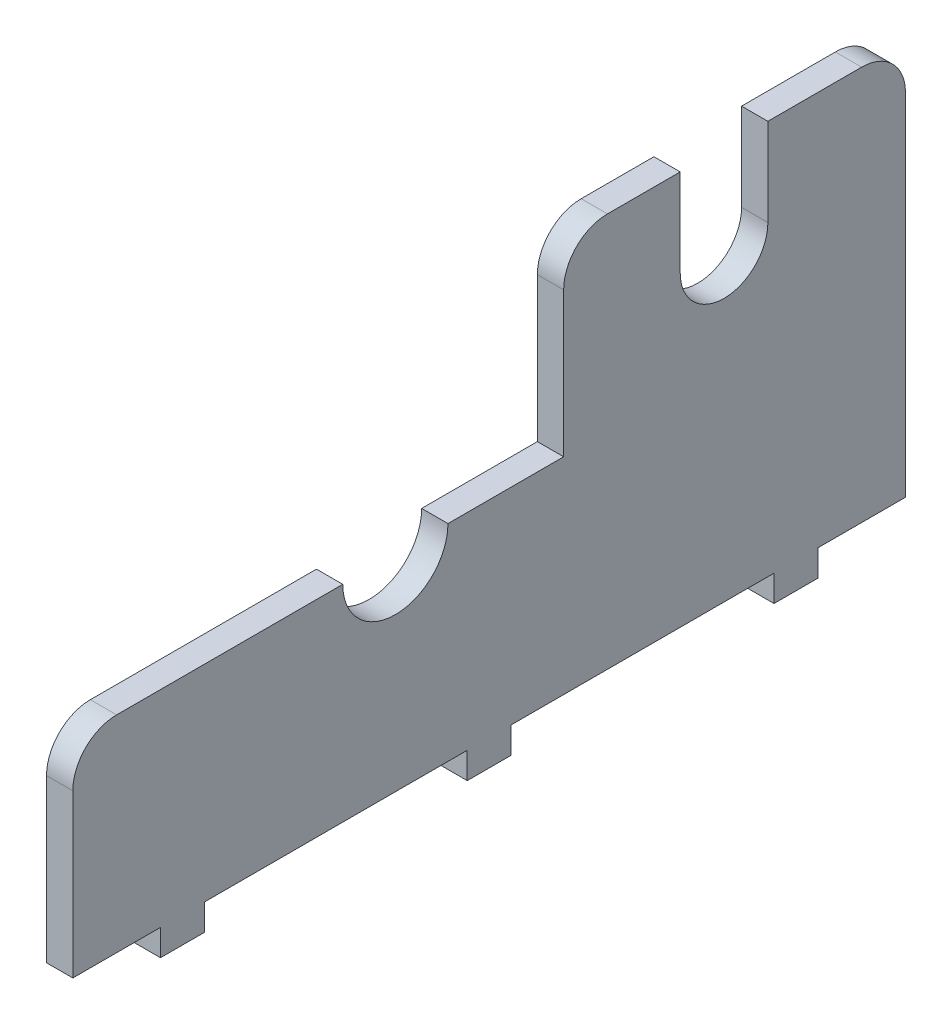
ISO-10303-21;
HEADER;
FILE_DESCRIPTION(('STEP AP214'),'2;1');
FILE_NAME('part.step','',(''),(''),'','','');
FILE_SCHEMA(('AUTOMOTIVE_DESIGN { 1 0 10303 214 1 1 1 1 }'));
ENDSEC;
DATA;
#1=APPLICATION_CONTEXT('core data for automotive mechanical design processes');
#2=APPLICATION_PROTOCOL_DEFINITION('international standard','automotive_design',2000,#1);
#3=PRODUCT_CONTEXT('',#1,'mechanical');
#4=PRODUCT('Part','Part','',(#3));
#5=PRODUCT_RELATED_PRODUCT_CATEGORY('part','',(#4));
#6=PRODUCT_DEFINITION_FORMATION('','',#4);
#7=PRODUCT_DEFINITION_CONTEXT('part definition',#1,'design');
#8=PRODUCT_DEFINITION('design','',#6,#7);
#9=PRODUCT_DEFINITION_SHAPE('','',#8);
#10=(LENGTH_UNIT() NAMED_UNIT(*) SI_UNIT(.MILLI.,.METRE.));
#11=(NAMED_UNIT(*) PLANE_ANGLE_UNIT() SI_UNIT($,.RADIAN.));
#12=(NAMED_UNIT(*) SI_UNIT($,.STERADIAN.) SOLID_ANGLE_UNIT());
#13=UNCERTAINTY_MEASURE_WITH_UNIT(LENGTH_MEASURE(1.E-05),#10,'distance_accuracy_value','');
#14=(GEOMETRIC_REPRESENTATION_CONTEXT(3) GLOBAL_UNCERTAINTY_ASSIGNED_CONTEXT((#13)) GLOBAL_UNIT_ASSIGNED_CONTEXT((#10,
#11,#12)) REPRESENTATION_CONTEXT('',''));
#15=CARTESIAN_POINT('',(0.,0.,0.));
#16=DIRECTION('',(0.,0.,1.));
#17=DIRECTION('',(1.,0.,0.));
#18=AXIS2_PLACEMENT_3D('',#15,#16,#17);
#19=CARTESIAN_POINT('',(3.,0.,-65.));
#20=DIRECTION('',(0.,1.,0.));
#21=DIRECTION('',(0.,0.,1.));
#22=AXIS2_PLACEMENT_3D('',#19,#20,#21);
#23=PLANE('',#22);
#24=DIRECTION('',(-1.,0.,0.));
#25=VECTOR('',#24,1.);
#26=CARTESIAN_POINT('',(3.,0.,-50.));
#27=LINE('',#26,#25);
#28=CARTESIAN_POINT('',(3.,0.,-50.));
#29=VERTEX_POINT('',#28);
#30=CARTESIAN_POINT('',(0.,0.,-50.));
#31=VERTEX_POINT('',#30);
#32=EDGE_CURVE('E62',#29,#31,#27,.T.);
#33=ORIENTED_EDGE('',*,*,#32,.F.);
#34=DIRECTION('',(0.,0.,-1.));
#35=VECTOR('',#34,1.);
#36=CARTESIAN_POINT('',(3.,0.,-65.));
#37=LINE('',#36,#35);
#38=CARTESIAN_POINT('',(3.,0.,-20.));
#39=VERTEX_POINT('',#38);
#40=EDGE_CURVE('E242',#39,#29,#37,.T.);
#41=ORIENTED_EDGE('',*,*,#40,.F.);
#42=DIRECTION('',(1.,0.,0.));
#43=VECTOR('',#42,1.);
#44=CARTESIAN_POINT('',(3.,0.,-20.));
#45=LINE('',#44,#43);
#46=CARTESIAN_POINT('',(0.,0.,-20.));
#47=VERTEX_POINT('',#46);
#48=EDGE_CURVE('E246',#47,#39,#45,.T.);
#49=ORIENTED_EDGE('',*,*,#48,.F.);
#50=DIRECTION('',(0.,0.,-1.));
#51=VECTOR('',#50,1.);
#52=CARTESIAN_POINT('',(0.,0.,-65.));
#53=LINE('',#52,#51);
#54=EDGE_CURVE('E441',#47,#31,#53,.T.);
#55=ORIENTED_EDGE('',*,*,#54,.T.);
#56=EDGE_LOOP('',(#33,#41,#49,#55));
#57=FACE_BOUND('',#56,.T.);
#58=ADVANCED_FACE('F39',(#57),#23,.F.);
#59=DIRECTION('',(1.,0.,0.));
#60=VECTOR('',#59,1.);
#61=CARTESIAN_POINT('',(3.,0.,-55.));
#62=LINE('',#61,#60);
#63=CARTESIAN_POINT('',(0.,0.,-55.));
#64=VERTEX_POINT('',#63);
#65=CARTESIAN_POINT('',(3.,0.,-55.));
#66=VERTEX_POINT('',#65);
#67=EDGE_CURVE('E237',#64,#66,#62,.T.);
#68=ORIENTED_EDGE('',*,*,#67,.F.);
#69=CARTESIAN_POINT('',(0.,0.,-65.));
#70=VERTEX_POINT('',#69);
#71=EDGE_CURVE('E365',#64,#70,#53,.T.);
#72=ORIENTED_EDGE('',*,*,#71,.T.);
#73=DIRECTION('',(-1.,0.,0.));
#74=VECTOR('',#73,1.);
#75=CARTESIAN_POINT('',(3.,0.,-65.));
#76=LINE('',#75,#74);
#77=CARTESIAN_POINT('',(3.,0.,-65.));
#78=VERTEX_POINT('',#77);
#79=EDGE_CURVE('E363',#78,#70,#76,.T.);
#80=ORIENTED_EDGE('',*,*,#79,.F.);
#81=EDGE_CURVE('E54',#66,#78,#37,.T.);
#82=ORIENTED_EDGE('',*,*,#81,.F.);
#83=EDGE_LOOP('',(#68,#72,#80,#82));
#84=FACE_BOUND('',#83,.T.);
#85=ADVANCED_FACE('F443',(#84),#23,.F.);
#86=DIRECTION('',(-1.,0.,0.));
#87=VECTOR('',#86,1.);
#88=CARTESIAN_POINT('',(3.,0.,-15.));
#89=LINE('',#88,#87);
#90=CARTESIAN_POINT('',(3.,0.,-15.));
#91=VERTEX_POINT('',#90);
#92=CARTESIAN_POINT('',(0.,0.,-15.));
#93=VERTEX_POINT('',#92);
#94=EDGE_CURVE('E243',#91,#93,#89,.T.);
#95=ORIENTED_EDGE('',*,*,#94,.F.);
#96=CARTESIAN_POINT('',(3.,0.,15.));
#97=VERTEX_POINT('',#96);
#98=EDGE_CURVE('E358',#97,#91,#37,.T.);
#99=ORIENTED_EDGE('',*,*,#98,.F.);
#100=DIRECTION('',(1.,0.,0.));
#101=VECTOR('',#100,1.);
#102=CARTESIAN_POINT('',(3.,0.,15.));
#103=LINE('',#102,#101);
#104=CARTESIAN_POINT('',(0.,0.,15.));
#105=VERTEX_POINT('',#104);
#106=EDGE_CURVE('E319',#105,#97,#103,.T.);
#107=ORIENTED_EDGE('',*,*,#106,.F.);
#108=EDGE_CURVE('E369',#105,#93,#53,.T.);
#109=ORIENTED_EDGE('',*,*,#108,.T.);
#110=EDGE_LOOP('',(#95,#99,#107,#109));
#111=FACE_BOUND('',#110,.T.);
#112=ADVANCED_FACE('F438',(#111),#23,.F.);
#113=CARTESIAN_POINT('',(0.,45.,0.));
#114=DIRECTION('',(0.,-1.,0.));
#115=DIRECTION('',(0.,0.,-1.));
#116=AXIS2_PLACEMENT_3D('',#113,#114,#115);
#117=PLANE('',#116);
#118=DIRECTION('',(0.,0.,1.));
#119=VECTOR('',#118,1.);
#120=CARTESIAN_POINT('',(0.,45.,-26.));
#121=LINE('',#120,#119);
#122=CARTESIAN_POINT('',(0.,45.,-39.3));
#123=VERTEX_POINT('',#122);
#124=CARTESIAN_POINT('',(0.,45.,-31.));
#125=VERTEX_POINT('',#124);
#126=EDGE_CURVE('E305',#123,#125,#121,.T.);
#127=ORIENTED_EDGE('',*,*,#126,.T.);
#128=DIRECTION('',(1.,0.,0.));
#129=VECTOR('',#128,1.);
#130=CARTESIAN_POINT('',(0.,45.,-31.));
#131=LINE('',#130,#129);
#132=CARTESIAN_POINT('',(3.,45.,-31.));
#133=VERTEX_POINT('',#132);
#134=EDGE_CURVE('E399',#125,#133,#131,.T.);
#135=ORIENTED_EDGE('',*,*,#134,.T.);
#136=DIRECTION('',(0.,0.,-1.));
#137=VECTOR('',#136,1.);
#138=CARTESIAN_POINT('',(3.,45.,-26.));
#139=LINE('',#138,#137);
#140=CARTESIAN_POINT('',(3.,45.,-39.3));
#141=VERTEX_POINT('',#140);
#142=EDGE_CURVE('E306',#133,#141,#139,.T.);
#143=ORIENTED_EDGE('',*,*,#142,.T.);
#144=DIRECTION('',(1.,0.,0.));
#145=VECTOR('',#144,1.);
#146=CARTESIAN_POINT('',(0.,45.,-39.3));
#147=LINE('',#146,#145);
#148=EDGE_CURVE('E295',#123,#141,#147,.T.);
#149=ORIENTED_EDGE('',*,*,#148,.F.);
#150=EDGE_LOOP('',(#127,#135,#143,#149));
#151=FACE_BOUND('',#150,.T.);
#152=ADVANCED_FACE('F487',(#151),#117,.F.);
#153=CARTESIAN_POINT('',(3.,23.5,-65.));
#154=DIRECTION('',(0.,-1.,0.));
#155=DIRECTION('',(0.,0.,-1.));
#156=AXIS2_PLACEMENT_3D('',#153,#154,#155);
#157=PLANE('',#156);
#158=DIRECTION('',(1.,0.,0.));
#159=VECTOR('',#158,1.);
#160=CARTESIAN_POINT('',(0.,23.5,-26.));
#161=LINE('',#160,#159);
#162=CARTESIAN_POINT('',(0.,23.5,-26.));
#163=VERTEX_POINT('',#162);
#164=CARTESIAN_POINT('',(3.,23.5,-26.));
#165=VERTEX_POINT('',#164);
#166=EDGE_CURVE('E294',#163,#165,#161,.T.);
#167=ORIENTED_EDGE('',*,*,#166,.F.);
#168=DIRECTION('',(0.,0.,1.));
#169=VECTOR('',#168,1.);
#170=CARTESIAN_POINT('',(0.,23.5,-65.));
#171=LINE('',#170,#169);
#172=CARTESIAN_POINT('',(0.,23.5,-12.8));
#173=VERTEX_POINT('',#172);
#174=EDGE_CURVE('E353',#163,#173,#171,.T.);
#175=ORIENTED_EDGE('',*,*,#174,.T.);
#176=DIRECTION('',(1.,0.,0.));
#177=VECTOR('',#176,1.);
#178=CARTESIAN_POINT('',(0.,23.5,-12.8));
#179=LINE('',#178,#177);
#180=CARTESIAN_POINT('',(3.,23.5,-12.8));
#181=VERTEX_POINT('',#180);
#182=EDGE_CURVE('E347',#173,#181,#179,.T.);
#183=ORIENTED_EDGE('',*,*,#182,.T.);
#184=DIRECTION('',(0.,0.,1.));
#185=VECTOR('',#184,1.);
#186=CARTESIAN_POINT('',(3.,23.5,-65.));
#187=LINE('',#186,#185);
#188=EDGE_CURVE('E361',#165,#181,#187,.T.);
#189=ORIENTED_EDGE('',*,*,#188,.F.);
#190=EDGE_LOOP('',(#167,#175,#183,#189));
#191=FACE_BOUND('',#190,.T.);
#192=ADVANCED_FACE('F491',(#191),#157,.F.);
#193=DIRECTION('',(-1.,0.,0.));
#194=VECTOR('',#193,1.);
#195=CARTESIAN_POINT('',(3.,0.,20.));
#196=LINE('',#195,#194);
#197=CARTESIAN_POINT('',(3.,0.,20.));
#198=VERTEX_POINT('',#197);
#199=CARTESIAN_POINT('',(0.,0.,20.));
#200=VERTEX_POINT('',#199);
#201=EDGE_CURVE('E314',#198,#200,#196,.T.);
#202=ORIENTED_EDGE('',*,*,#201,.F.);
#203=CARTESIAN_POINT('',(3.,0.,30.));
#204=VERTEX_POINT('',#203);
#205=EDGE_CURVE('E354',#204,#198,#37,.T.);
#206=ORIENTED_EDGE('',*,*,#205,.F.);
#207=DIRECTION('',(-1.,0.,0.));
#208=VECTOR('',#207,1.);
#209=CARTESIAN_POINT('',(3.,0.,30.));
#210=LINE('',#209,#208);
#211=CARTESIAN_POINT('',(0.,0.,30.));
#212=VERTEX_POINT('',#211);
#213=EDGE_CURVE('E376',#204,#212,#210,.T.);
#214=ORIENTED_EDGE('',*,*,#213,.T.);
#215=EDGE_CURVE('E366',#212,#200,#53,.T.);
#216=ORIENTED_EDGE('',*,*,#215,.T.);
#217=EDGE_LOOP('',(#202,#206,#214,#216));
#218=FACE_BOUND('',#217,.T.);
#219=ADVANCED_FACE('F422',(#218),#23,.F.);
#220=CARTESIAN_POINT('',(3.,0.,30.));
#221=DIRECTION('',(0.,0.,-1.));
#222=DIRECTION('',(-1.,0.,0.));
#223=AXIS2_PLACEMENT_3D('',#220,#221,#222);
#224=PLANE('',#223);
#225=DIRECTION('',(0.,-1.,0.));
#226=VECTOR('',#225,1.);
#227=CARTESIAN_POINT('',(3.,0.,30.));
#228=LINE('',#227,#226);
#229=CARTESIAN_POINT('',(3.,18.5,30.));
#230=VERTEX_POINT('',#229);
#231=EDGE_CURVE('E351',#230,#204,#228,.T.);
#232=ORIENTED_EDGE('',*,*,#231,.F.);
#233=DIRECTION('',(-1.,0.,0.));
#234=VECTOR('',#233,1.);
#235=CARTESIAN_POINT('',(3.,18.5,30.));
#236=LINE('',#235,#234);
#237=CARTESIAN_POINT('',(0.,18.5,30.));
#238=VERTEX_POINT('',#237);
#239=EDGE_CURVE('E47',#230,#238,#236,.T.);
#240=ORIENTED_EDGE('',*,*,#239,.T.);
#241=DIRECTION('',(0.,-1.,0.));
#242=VECTOR('',#241,1.);
#243=CARTESIAN_POINT('',(0.,0.,30.));
#244=LINE('',#243,#242);
#245=EDGE_CURVE('E350',#238,#212,#244,.T.);
#246=ORIENTED_EDGE('',*,*,#245,.T.);
#247=ORIENTED_EDGE('',*,*,#213,.F.);
#248=EDGE_LOOP('',(#232,#240,#246,#247));
#249=FACE_BOUND('',#248,.T.);
#250=ADVANCED_FACE('F408',(#249),#224,.F.);
#251=CARTESIAN_POINT('',(3.,0.,-65.));
#252=DIRECTION('',(0.,0.,1.));
#253=DIRECTION('',(1.,0.,0.));
#254=AXIS2_PLACEMENT_3D('',#251,#252,#253);
#255=PLANE('',#254);
#256=DIRECTION('',(0.,1.,0.));
#257=VECTOR('',#256,1.);
#258=CARTESIAN_POINT('',(0.,0.,-65.));
#259=LINE('',#258,#257);
#260=CARTESIAN_POINT('',(0.,40.,-65.));
#261=VERTEX_POINT('',#260);
#262=EDGE_CURVE('E368',#70,#261,#259,.T.);
#263=ORIENTED_EDGE('',*,*,#262,.T.);
#264=DIRECTION('',(-1.,0.,0.));
#265=VECTOR('',#264,1.);
#266=CARTESIAN_POINT('',(3.,40.,-65.));
#267=LINE('',#266,#265);
#268=CARTESIAN_POINT('',(3.,40.,-65.));
#269=VERTEX_POINT('',#268);
#270=EDGE_CURVE('E391',#261,#269,#267,.F.);
#271=ORIENTED_EDGE('',*,*,#270,.T.);
#272=DIRECTION('',(0.,1.,0.));
#273=VECTOR('',#272,1.);
#274=CARTESIAN_POINT('',(3.,0.,-65.));
#275=LINE('',#274,#273);
#276=EDGE_CURVE('E357',#78,#269,#275,.T.);
#277=ORIENTED_EDGE('',*,*,#276,.F.);
#278=ORIENTED_EDGE('',*,*,#79,.T.);
#279=EDGE_LOOP('',(#263,#271,#277,#278));
#280=FACE_BOUND('',#279,.T.);
#281=ADVANCED_FACE('F449',(#280),#255,.F.);
#282=CARTESIAN_POINT('',(0.,23.5,-0.799999999999991));
#283=VERTEX_POINT('',#282);
#284=CARTESIAN_POINT('',(0.,23.5,25.));
#285=VERTEX_POINT('',#284);
#286=EDGE_CURVE('E372',#283,#285,#171,.T.);
#287=ORIENTED_EDGE('',*,*,#286,.T.);
#288=DIRECTION('',(-1.,0.,0.));
#289=VECTOR('',#288,1.);
#290=CARTESIAN_POINT('',(3.,23.5,25.));
#291=LINE('',#290,#289);
#292=CARTESIAN_POINT('',(3.,23.5,25.));
#293=VERTEX_POINT('',#292);
#294=EDGE_CURVE('E11',#285,#293,#291,.F.);
#295=ORIENTED_EDGE('',*,*,#294,.T.);
#296=CARTESIAN_POINT('',(3.,23.5,-0.799999999999991));
#297=VERTEX_POINT('',#296);
#298=EDGE_CURVE('E360',#297,#293,#187,.T.);
#299=ORIENTED_EDGE('',*,*,#298,.F.);
#300=DIRECTION('',(1.,0.,0.));
#301=VECTOR('',#300,1.);
#302=CARTESIAN_POINT('',(0.,23.5,-0.799999999999991));
#303=LINE('',#302,#301);
#304=EDGE_CURVE('E344',#297,#283,#303,.F.);
#305=ORIENTED_EDGE('',*,*,#304,.T.);
#306=EDGE_LOOP('',(#287,#295,#299,#305));
#307=FACE_BOUND('',#306,.T.);
#308=ADVANCED_FACE('F501',(#307),#157,.F.);
#309=CARTESIAN_POINT('',(3.,0.,0.));
#310=DIRECTION('',(1.,0.,0.));
#311=DIRECTION('',(0.,0.,-1.));
#312=AXIS2_PLACEMENT_3D('',#309,#310,#311);
#313=PLANE('',#312);
#314=ORIENTED_EDGE('',*,*,#276,.T.);
#315=CARTESIAN_POINT('',(3.,40.,-60.));
#316=DIRECTION('',(1.,0.,0.));
#317=DIRECTION('',(0.,0.,-1.));
#318=AXIS2_PLACEMENT_3D('',#315,#316,#317);
#319=CIRCLE('',#318,5.);
#320=CARTESIAN_POINT('',(3.,45.,-60.));
#321=VERTEX_POINT('',#320);
#322=EDGE_CURVE('E397',#269,#321,#319,.T.);
#323=ORIENTED_EDGE('',*,*,#322,.T.);
#324=CARTESIAN_POINT('',(3.,45.,-49.3));
#325=VERTEX_POINT('',#324);
#326=EDGE_CURVE('E304',#325,#321,#139,.T.);
#327=ORIENTED_EDGE('',*,*,#326,.F.);
#328=DIRECTION('',(0.,1.,0.));
#329=VECTOR('',#328,1.);
#330=CARTESIAN_POINT('',(3.,45.,-49.3));
#331=LINE('',#330,#329);
#332=CARTESIAN_POINT('',(3.,35.,-49.3));
#333=VERTEX_POINT('',#332);
#334=EDGE_CURVE('E288',#333,#325,#331,.T.);
#335=ORIENTED_EDGE('',*,*,#334,.F.);
#336=CARTESIAN_POINT('',(3.,35.,-44.3));
#337=DIRECTION('',(1.,0.,0.));
#338=DIRECTION('',(0.,0.,-1.));
#339=AXIS2_PLACEMENT_3D('',#336,#337,#338);
#340=CIRCLE('',#339,5.);
#341=CARTESIAN_POINT('',(3.,35.,-39.3));
#342=VERTEX_POINT('',#341);
#343=EDGE_CURVE('E274',#342,#333,#340,.T.);
#344=ORIENTED_EDGE('',*,*,#343,.F.);
#345=DIRECTION('',(0.,-1.,0.));
#346=VECTOR('',#345,1.);
#347=CARTESIAN_POINT('',(3.,35.,-39.3));
#348=LINE('',#347,#346);
#349=EDGE_CURVE('E279',#141,#342,#348,.T.);
#350=ORIENTED_EDGE('',*,*,#349,.F.);
#351=ORIENTED_EDGE('',*,*,#142,.F.);
#352=CARTESIAN_POINT('',(3.,40.,-31.));
#353=DIRECTION('',(1.,0.,0.));
#354=DIRECTION('',(0.,0.,-1.));
#355=AXIS2_PLACEMENT_3D('',#352,#353,#354);
#356=CIRCLE('',#355,5.);
#357=CARTESIAN_POINT('',(3.,40.,-26.));
#358=VERTEX_POINT('',#357);
#359=EDGE_CURVE('E395',#133,#358,#356,.T.);
#360=ORIENTED_EDGE('',*,*,#359,.T.);
#361=DIRECTION('',(0.,-1.,0.));
#362=VECTOR('',#361,1.);
#363=CARTESIAN_POINT('',(3.,45.,-26.));
#364=LINE('',#363,#362);
#365=EDGE_CURVE('E308',#358,#165,#364,.T.);
#366=ORIENTED_EDGE('',*,*,#365,.T.);
#367=ORIENTED_EDGE('',*,*,#188,.T.);
#368=CARTESIAN_POINT('',(3.,23.5,-6.79999999999999));
#369=DIRECTION('',(1.,0.,0.));
#370=DIRECTION('',(0.,0.,-1.));
#371=AXIS2_PLACEMENT_3D('',#368,#369,#370);
#372=CIRCLE('',#371,6.);
#373=EDGE_CURVE('E341',#297,#181,#372,.T.);
#374=ORIENTED_EDGE('',*,*,#373,.F.);
#375=ORIENTED_EDGE('',*,*,#298,.T.);
#376=CARTESIAN_POINT('',(3.,18.5,25.));
#377=DIRECTION('',(1.,0.,0.));
#378=DIRECTION('',(0.,0.,-1.));
#379=AXIS2_PLACEMENT_3D('',#376,#377,#378);
#380=CIRCLE('',#379,5.);
#381=EDGE_CURVE('E393',#293,#230,#380,.T.);
#382=ORIENTED_EDGE('',*,*,#381,.T.);
#383=ORIENTED_EDGE('',*,*,#231,.T.);
#384=ORIENTED_EDGE('',*,*,#205,.T.);
#385=DIRECTION('',(0.,1.,0.));
#386=VECTOR('',#385,1.);
#387=CARTESIAN_POINT('',(3.,-3.,20.));
#388=LINE('',#387,#386);
#389=CARTESIAN_POINT('',(3.,-3.,20.));
#390=VERTEX_POINT('',#389);
#391=EDGE_CURVE('E338',#390,#198,#388,.T.);
#392=ORIENTED_EDGE('',*,*,#391,.F.);
#393=DIRECTION('',(0.,0.,1.));
#394=VECTOR('',#393,1.);
#395=CARTESIAN_POINT('',(3.,-3.,20.));
#396=LINE('',#395,#394);
#397=CARTESIAN_POINT('',(3.,-3.,15.));
#398=VERTEX_POINT('',#397);
#399=EDGE_CURVE('E315',#398,#390,#396,.T.);
#400=ORIENTED_EDGE('',*,*,#399,.F.);
#401=DIRECTION('',(0.,1.,0.));
#402=VECTOR('',#401,1.);
#403=CARTESIAN_POINT('',(3.,-3.,15.));
#404=LINE('',#403,#402);
#405=EDGE_CURVE('E325',#398,#97,#404,.T.);
#406=ORIENTED_EDGE('',*,*,#405,.T.);
#407=ORIENTED_EDGE('',*,*,#98,.T.);
#408=DIRECTION('',(0.,1.,0.));
#409=VECTOR('',#408,1.);
#410=CARTESIAN_POINT('',(3.,-3.,-15.));
#411=LINE('',#410,#409);
#412=CARTESIAN_POINT('',(3.,-3.,-15.));
#413=VERTEX_POINT('',#412);
#414=EDGE_CURVE('E271',#413,#91,#411,.T.);
#415=ORIENTED_EDGE('',*,*,#414,.F.);
#416=DIRECTION('',(0.,0.,1.));
#417=VECTOR('',#416,1.);
#418=CARTESIAN_POINT('',(3.,-3.,-15.));
#419=LINE('',#418,#417);
#420=CARTESIAN_POINT('',(3.,-3.,-20.));
#421=VERTEX_POINT('',#420);
#422=EDGE_CURVE('E252',#421,#413,#419,.T.);
#423=ORIENTED_EDGE('',*,*,#422,.F.);
#424=DIRECTION('',(0.,1.,0.));
#425=VECTOR('',#424,1.);
#426=CARTESIAN_POINT('',(3.,-3.,-20.));
#427=LINE('',#426,#425);
#428=EDGE_CURVE('E260',#421,#39,#427,.T.);
#429=ORIENTED_EDGE('',*,*,#428,.T.);
#430=ORIENTED_EDGE('',*,*,#40,.T.);
#431=DIRECTION('',(0.,1.,0.));
#432=VECTOR('',#431,1.);
#433=CARTESIAN_POINT('',(3.,-2.99999999999999,-50.));
#434=LINE('',#433,#432);
#435=CARTESIAN_POINT('',(3.,-2.99999999999999,-50.));
#436=VERTEX_POINT('',#435);
#437=EDGE_CURVE('E222',#436,#29,#434,.T.);
#438=ORIENTED_EDGE('',*,*,#437,.F.);
#439=DIRECTION('',(0.,0.,1.));
#440=VECTOR('',#439,1.);
#441=CARTESIAN_POINT('',(3.,-2.99999999999999,-50.));
#442=LINE('',#441,#440);
#443=CARTESIAN_POINT('',(3.,-2.99999999999999,-55.));
#444=VERTEX_POINT('',#443);
#445=EDGE_CURVE('E228',#444,#436,#442,.T.);
#446=ORIENTED_EDGE('',*,*,#445,.F.);
#447=DIRECTION('',(0.,1.,0.));
#448=VECTOR('',#447,1.);
#449=CARTESIAN_POINT('',(3.,-2.99999999999999,-55.));
#450=LINE('',#449,#448);
#451=EDGE_CURVE('E462',#444,#66,#450,.T.);
#452=ORIENTED_EDGE('',*,*,#451,.T.);
#453=ORIENTED_EDGE('',*,*,#81,.T.);
#454=EDGE_LOOP('',(#314,#323,#327,#335,#344,#350,#351,#360,#366,#367,#374,#375,#382,#383,#384,
#392,#400,#406,#407,#415,#423,#429,#430,#438,#446,#452,#453));
#455=FACE_BOUND('',#454,.T.);
#456=ADVANCED_FACE('F240',(#455),#313,.T.);
#457=CARTESIAN_POINT('',(0.,0.,0.));
#458=DIRECTION('',(1.,0.,0.));
#459=DIRECTION('',(0.,0.,-1.));
#460=AXIS2_PLACEMENT_3D('',#457,#458,#459);
#461=PLANE('',#460);
#462=CARTESIAN_POINT('',(0.,45.,-60.));
#463=VERTEX_POINT('',#462);
#464=CARTESIAN_POINT('',(0.,45.,-49.3));
#465=VERTEX_POINT('',#464);
#466=EDGE_CURVE('E302',#463,#465,#121,.T.);
#467=ORIENTED_EDGE('',*,*,#466,.F.);
#468=CARTESIAN_POINT('',(0.,40.,-60.));
#469=DIRECTION('',(1.,0.,0.));
#470=DIRECTION('',(0.,0.,-1.));
#471=AXIS2_PLACEMENT_3D('',#468,#469,#470);
#472=CIRCLE('',#471,5.);
#473=EDGE_CURVE('E389',#463,#261,#472,.F.);
#474=ORIENTED_EDGE('',*,*,#473,.T.);
#475=ORIENTED_EDGE('',*,*,#262,.F.);
#476=ORIENTED_EDGE('',*,*,#71,.F.);
#477=DIRECTION('',(0.,1.,0.));
#478=VECTOR('',#477,1.);
#479=CARTESIAN_POINT('',(0.,-2.99999999999999,-55.));
#480=LINE('',#479,#478);
#481=CARTESIAN_POINT('',(0.,-2.99999999999999,-55.));
#482=VERTEX_POINT('',#481);
#483=EDGE_CURVE('E248',#482,#64,#480,.T.);
#484=ORIENTED_EDGE('',*,*,#483,.F.);
#485=DIRECTION('',(0.,0.,-1.));
#486=VECTOR('',#485,1.);
#487=CARTESIAN_POINT('',(0.,-2.99999999999999,-50.));
#488=LINE('',#487,#486);
#489=CARTESIAN_POINT('',(0.,-2.99999999999999,-50.));
#490=VERTEX_POINT('',#489);
#491=EDGE_CURVE('E227',#490,#482,#488,.T.);
#492=ORIENTED_EDGE('',*,*,#491,.F.);
#493=DIRECTION('',(0.,1.,0.));
#494=VECTOR('',#493,1.);
#495=CARTESIAN_POINT('',(0.,-2.99999999999999,-50.));
#496=LINE('',#495,#494);
#497=EDGE_CURVE('E224',#490,#31,#496,.T.);
#498=ORIENTED_EDGE('',*,*,#497,.T.);
#499=ORIENTED_EDGE('',*,*,#54,.F.);
#500=DIRECTION('',(0.,1.,0.));
#501=VECTOR('',#500,1.);
#502=CARTESIAN_POINT('',(0.,-3.,-20.));
#503=LINE('',#502,#501);
#504=CARTESIAN_POINT('',(0.,-3.,-20.));
#505=VERTEX_POINT('',#504);
#506=EDGE_CURVE('E265',#505,#47,#503,.T.);
#507=ORIENTED_EDGE('',*,*,#506,.F.);
#508=DIRECTION('',(0.,0.,-1.));
#509=VECTOR('',#508,1.);
#510=CARTESIAN_POINT('',(0.,-3.,-15.));
#511=LINE('',#510,#509);
#512=CARTESIAN_POINT('',(0.,-3.,-15.));
#513=VERTEX_POINT('',#512);
#514=EDGE_CURVE('E257',#513,#505,#511,.T.);
#515=ORIENTED_EDGE('',*,*,#514,.F.);
#516=DIRECTION('',(0.,1.,0.));
#517=VECTOR('',#516,1.);
#518=CARTESIAN_POINT('',(0.,-3.,-15.));
#519=LINE('',#518,#517);
#520=EDGE_CURVE('E268',#513,#93,#519,.T.);
#521=ORIENTED_EDGE('',*,*,#520,.T.);
#522=ORIENTED_EDGE('',*,*,#108,.F.);
#523=DIRECTION('',(0.,1.,0.));
#524=VECTOR('',#523,1.);
#525=CARTESIAN_POINT('',(0.,-3.,15.));
#526=LINE('',#525,#524);
#527=CARTESIAN_POINT('',(0.,-3.,15.));
#528=VERTEX_POINT('',#527);
#529=EDGE_CURVE('E332',#528,#105,#526,.T.);
#530=ORIENTED_EDGE('',*,*,#529,.F.);
#531=DIRECTION('',(0.,0.,-1.));
#532=VECTOR('',#531,1.);
#533=CARTESIAN_POINT('',(0.,-3.,20.));
#534=LINE('',#533,#532);
#535=CARTESIAN_POINT('',(0.,-3.,20.));
#536=VERTEX_POINT('',#535);
#537=EDGE_CURVE('E321',#536,#528,#534,.T.);
#538=ORIENTED_EDGE('',*,*,#537,.F.);
#539=DIRECTION('',(0.,1.,0.));
#540=VECTOR('',#539,1.);
#541=CARTESIAN_POINT('',(0.,-3.,20.));
#542=LINE('',#541,#540);
#543=EDGE_CURVE('E335',#536,#200,#542,.T.);
#544=ORIENTED_EDGE('',*,*,#543,.T.);
#545=ORIENTED_EDGE('',*,*,#215,.F.);
#546=ORIENTED_EDGE('',*,*,#245,.F.);
#547=CARTESIAN_POINT('',(0.,18.5,25.));
#548=DIRECTION('',(1.,0.,0.));
#549=DIRECTION('',(0.,0.,-1.));
#550=AXIS2_PLACEMENT_3D('',#547,#548,#549);
#551=CIRCLE('',#550,5.);
#552=EDGE_CURVE('E385',#238,#285,#551,.F.);
#553=ORIENTED_EDGE('',*,*,#552,.T.);
#554=ORIENTED_EDGE('',*,*,#286,.F.);
#555=CARTESIAN_POINT('',(0.,23.5,-6.79999999999999));
#556=DIRECTION('',(1.,0.,0.));
#557=DIRECTION('',(0.,0.,-1.));
#558=AXIS2_PLACEMENT_3D('',#555,#556,#557);
#559=CIRCLE('',#558,6.);
#560=EDGE_CURVE('E379',#283,#173,#559,.T.);
#561=ORIENTED_EDGE('',*,*,#560,.T.);
#562=ORIENTED_EDGE('',*,*,#174,.F.);
#563=DIRECTION('',(0.,-1.,0.));
#564=VECTOR('',#563,1.);
#565=CARTESIAN_POINT('',(0.,45.,-26.));
#566=LINE('',#565,#564);
#567=CARTESIAN_POINT('',(0.,40.,-26.));
#568=VERTEX_POINT('',#567);
#569=EDGE_CURVE('E312',#568,#163,#566,.T.);
#570=ORIENTED_EDGE('',*,*,#569,.F.);
#571=CARTESIAN_POINT('',(0.,40.,-31.));
#572=DIRECTION('',(1.,0.,0.));
#573=DIRECTION('',(0.,0.,-1.));
#574=AXIS2_PLACEMENT_3D('',#571,#572,#573);
#575=CIRCLE('',#574,5.);
#576=EDGE_CURVE('E387',#568,#125,#575,.F.);
#577=ORIENTED_EDGE('',*,*,#576,.T.);
#578=ORIENTED_EDGE('',*,*,#126,.F.);
#579=DIRECTION('',(0.,-1.,0.));
#580=VECTOR('',#579,1.);
#581=CARTESIAN_POINT('',(0.,35.,-39.3));
#582=LINE('',#581,#580);
#583=CARTESIAN_POINT('',(0.,35.,-39.3));
#584=VERTEX_POINT('',#583);
#585=EDGE_CURVE('E282',#123,#584,#582,.T.);
#586=ORIENTED_EDGE('',*,*,#585,.T.);
#587=CARTESIAN_POINT('',(0.,35.,-44.3));
#588=DIRECTION('',(1.,0.,0.));
#589=DIRECTION('',(0.,0.,-1.));
#590=AXIS2_PLACEMENT_3D('',#587,#588,#589);
#591=CIRCLE('',#590,5.);
#592=CARTESIAN_POINT('',(0.,35.,-49.3));
#593=VERTEX_POINT('',#592);
#594=EDGE_CURVE('E275',#584,#593,#591,.T.);
#595=ORIENTED_EDGE('',*,*,#594,.T.);
#596=DIRECTION('',(0.,1.,0.));
#597=VECTOR('',#596,1.);
#598=CARTESIAN_POINT('',(0.,45.,-49.3));
#599=LINE('',#598,#597);
#600=EDGE_CURVE('E278',#593,#465,#599,.T.);
#601=ORIENTED_EDGE('',*,*,#600,.T.);
#602=EDGE_LOOP('',(#467,#474,#475,#476,#484,#492,#498,#499,#507,#515,#521,#522,#530,#538,#544,
#545,#546,#553,#554,#561,#562,#570,#577,#578,#586,#595,#601));
#603=FACE_BOUND('',#602,.T.);
#604=ADVANCED_FACE('F415',(#603),#461,.F.);
#605=CARTESIAN_POINT('',(0.,23.5,-6.79999999999999));
#606=DIRECTION('',(1.,0.,0.));
#607=DIRECTION('',(0.,0.,-1.));
#608=AXIS2_PLACEMENT_3D('',#605,#606,#607);
#609=CYLINDRICAL_SURFACE('',#608,6.);
#610=ORIENTED_EDGE('',*,*,#560,.F.);
#611=ORIENTED_EDGE('',*,*,#304,.F.);
#612=ORIENTED_EDGE('',*,*,#373,.T.);
#613=ORIENTED_EDGE('',*,*,#182,.F.);
#614=EDGE_LOOP('',(#610,#611,#612,#613));
#615=FACE_BOUND('',#614,.T.);
#616=ADVANCED_FACE('F520',(#615),#609,.F.);
#617=CARTESIAN_POINT('',(3.,-3.,20.));
#618=DIRECTION('',(0.,0.,-1.));
#619=DIRECTION('',(0.,1.,0.));
#620=AXIS2_PLACEMENT_3D('',#617,#618,#619);
#621=PLANE('',#620);
#622=ORIENTED_EDGE('',*,*,#201,.T.);
#623=ORIENTED_EDGE('',*,*,#543,.F.);
#624=DIRECTION('',(-1.,0.,0.));
#625=VECTOR('',#624,1.);
#626=CARTESIAN_POINT('',(3.,-3.,20.));
#627=LINE('',#626,#625);
#628=EDGE_CURVE('E318',#390,#536,#627,.T.);
#629=ORIENTED_EDGE('',*,*,#628,.F.);
#630=ORIENTED_EDGE('',*,*,#391,.T.);
#631=EDGE_LOOP('',(#622,#623,#629,#630));
#632=FACE_BOUND('',#631,.T.);
#633=ADVANCED_FACE('F426',(#632),#621,.F.);
#634=CARTESIAN_POINT('',(3.,-3.,15.));
#635=DIRECTION('',(0.,0.,1.));
#636=DIRECTION('',(0.,-1.,0.));
#637=AXIS2_PLACEMENT_3D('',#634,#635,#636);
#638=PLANE('',#637);
#639=ORIENTED_EDGE('',*,*,#106,.T.);
#640=ORIENTED_EDGE('',*,*,#405,.F.);
#641=DIRECTION('',(1.,0.,0.));
#642=VECTOR('',#641,1.);
#643=CARTESIAN_POINT('',(3.,-3.,15.));
#644=LINE('',#643,#642);
#645=EDGE_CURVE('E323',#528,#398,#644,.T.);
#646=ORIENTED_EDGE('',*,*,#645,.F.);
#647=ORIENTED_EDGE('',*,*,#529,.T.);
#648=EDGE_LOOP('',(#639,#640,#646,#647));
#649=FACE_BOUND('',#648,.T.);
#650=ADVANCED_FACE('F434',(#649),#638,.F.);
#651=CARTESIAN_POINT('',(0.,-3.,0.));
#652=DIRECTION('',(0.,1.,0.));
#653=DIRECTION('',(0.,0.,1.));
#654=AXIS2_PLACEMENT_3D('',#651,#652,#653);
#655=PLANE('',#654);
#656=ORIENTED_EDGE('',*,*,#399,.T.);
#657=ORIENTED_EDGE('',*,*,#628,.T.);
#658=ORIENTED_EDGE('',*,*,#537,.T.);
#659=ORIENTED_EDGE('',*,*,#645,.T.);
#660=EDGE_LOOP('',(#656,#657,#658,#659));
#661=FACE_BOUND('',#660,.T.);
#662=ADVANCED_FACE('F428',(#661),#655,.F.);
#663=CARTESIAN_POINT('',(0.,45.,-26.));
#664=DIRECTION('',(0.,0.,-1.));
#665=DIRECTION('',(0.,1.,0.));
#666=AXIS2_PLACEMENT_3D('',#663,#664,#665);
#667=PLANE('',#666);
#668=ORIENTED_EDGE('',*,*,#365,.F.);
#669=DIRECTION('',(1.,0.,0.));
#670=VECTOR('',#669,1.);
#671=CARTESIAN_POINT('',(0.,40.,-26.));
#672=LINE('',#671,#670);
#673=EDGE_CURVE('E402',#358,#568,#672,.F.);
#674=ORIENTED_EDGE('',*,*,#673,.T.);
#675=ORIENTED_EDGE('',*,*,#569,.T.);
#676=ORIENTED_EDGE('',*,*,#166,.T.);
#677=EDGE_LOOP('',(#668,#674,#675,#676));
#678=FACE_BOUND('',#677,.T.);
#679=ADVANCED_FACE('F556',(#678),#667,.F.);
#680=ORIENTED_EDGE('',*,*,#326,.T.);
#681=DIRECTION('',(-1.,0.,0.));
#682=VECTOR('',#681,1.);
#683=CARTESIAN_POINT('',(0.,45.,-60.));
#684=LINE('',#683,#682);
#685=EDGE_CURVE('E382',#321,#463,#684,.T.);
#686=ORIENTED_EDGE('',*,*,#685,.T.);
#687=ORIENTED_EDGE('',*,*,#466,.T.);
#688=DIRECTION('',(1.,0.,0.));
#689=VECTOR('',#688,1.);
#690=CARTESIAN_POINT('',(0.,45.,-49.3));
#691=LINE('',#690,#689);
#692=EDGE_CURVE('E298',#465,#325,#691,.T.);
#693=ORIENTED_EDGE('',*,*,#692,.T.);
#694=EDGE_LOOP('',(#680,#686,#687,#693));
#695=FACE_BOUND('',#694,.T.);
#696=ADVANCED_FACE('F457',(#695),#117,.F.);
#697=CARTESIAN_POINT('',(0.,35.,-44.3));
#698=DIRECTION('',(1.,0.,0.));
#699=DIRECTION('',(0.,0.,-1.));
#700=AXIS2_PLACEMENT_3D('',#697,#698,#699);
#701=CYLINDRICAL_SURFACE('',#700,5.);
#702=ORIENTED_EDGE('',*,*,#343,.T.);
#703=DIRECTION('',(1.,0.,0.));
#704=VECTOR('',#703,1.);
#705=CARTESIAN_POINT('',(0.,35.,-49.3));
#706=LINE('',#705,#704);
#707=EDGE_CURVE('E285',#593,#333,#706,.T.);
#708=ORIENTED_EDGE('',*,*,#707,.F.);
#709=ORIENTED_EDGE('',*,*,#594,.F.);
#710=DIRECTION('',(1.,0.,0.));
#711=VECTOR('',#710,1.);
#712=CARTESIAN_POINT('',(0.,35.,-39.3));
#713=LINE('',#712,#711);
#714=EDGE_CURVE('E292',#584,#342,#713,.T.);
#715=ORIENTED_EDGE('',*,*,#714,.T.);
#716=EDGE_LOOP('',(#702,#708,#709,#715));
#717=FACE_BOUND('',#716,.T.);
#718=ADVANCED_FACE('F540',(#717),#701,.F.);
#719=CARTESIAN_POINT('',(0.,35.,-39.3));
#720=DIRECTION('',(0.,0.,1.));
#721=DIRECTION('',(1.,0.,0.));
#722=AXIS2_PLACEMENT_3D('',#719,#720,#721);
#723=PLANE('',#722);
#724=ORIENTED_EDGE('',*,*,#349,.T.);
#725=ORIENTED_EDGE('',*,*,#714,.F.);
#726=ORIENTED_EDGE('',*,*,#585,.F.);
#727=ORIENTED_EDGE('',*,*,#148,.T.);
#728=EDGE_LOOP('',(#724,#725,#726,#727));
#729=FACE_BOUND('',#728,.T.);
#730=ADVANCED_FACE('F536',(#729),#723,.F.);
#731=CARTESIAN_POINT('',(0.,45.,-49.3));
#732=DIRECTION('',(0.,0.,-1.));
#733=DIRECTION('',(-1.,0.,0.));
#734=AXIS2_PLACEMENT_3D('',#731,#732,#733);
#735=PLANE('',#734);
#736=ORIENTED_EDGE('',*,*,#334,.T.);
#737=ORIENTED_EDGE('',*,*,#692,.F.);
#738=ORIENTED_EDGE('',*,*,#600,.F.);
#739=ORIENTED_EDGE('',*,*,#707,.T.);
#740=EDGE_LOOP('',(#736,#737,#738,#739));
#741=FACE_BOUND('',#740,.T.);
#742=ADVANCED_FACE('F542',(#741),#735,.F.);
#743=CARTESIAN_POINT('',(0.,40.,-60.));
#744=DIRECTION('',(-1.,0.,0.));
#745=DIRECTION('',(0.,0.,1.));
#746=AXIS2_PLACEMENT_3D('',#743,#744,#745);
#747=CYLINDRICAL_SURFACE('',#746,5.);
#748=ORIENTED_EDGE('',*,*,#322,.F.);
#749=ORIENTED_EDGE('',*,*,#270,.F.);
#750=ORIENTED_EDGE('',*,*,#473,.F.);
#751=ORIENTED_EDGE('',*,*,#685,.F.);
#752=EDGE_LOOP('',(#748,#749,#750,#751));
#753=FACE_BOUND('',#752,.T.);
#754=ADVANCED_FACE('F454',(#753),#747,.T.);
#755=CARTESIAN_POINT('',(0.,40.,-31.));
#756=DIRECTION('',(1.,0.,0.));
#757=DIRECTION('',(0.,0.,-1.));
#758=AXIS2_PLACEMENT_3D('',#755,#756,#757);
#759=CYLINDRICAL_SURFACE('',#758,5.);
#760=ORIENTED_EDGE('',*,*,#576,.F.);
#761=ORIENTED_EDGE('',*,*,#673,.F.);
#762=ORIENTED_EDGE('',*,*,#359,.F.);
#763=ORIENTED_EDGE('',*,*,#134,.F.);
#764=EDGE_LOOP('',(#760,#761,#762,#763));
#765=FACE_BOUND('',#764,.T.);
#766=ADVANCED_FACE('F530',(#765),#759,.T.);
#767=CARTESIAN_POINT('',(3.,18.5,25.));
#768=DIRECTION('',(-1.,0.,0.));
#769=DIRECTION('',(0.,0.,1.));
#770=AXIS2_PLACEMENT_3D('',#767,#768,#769);
#771=CYLINDRICAL_SURFACE('',#770,5.);
#772=ORIENTED_EDGE('',*,*,#381,.F.);
#773=ORIENTED_EDGE('',*,*,#294,.F.);
#774=ORIENTED_EDGE('',*,*,#552,.F.);
#775=ORIENTED_EDGE('',*,*,#239,.F.);
#776=EDGE_LOOP('',(#772,#773,#774,#775));
#777=FACE_BOUND('',#776,.T.);
#778=ADVANCED_FACE('F41',(#777),#771,.T.);
#779=CARTESIAN_POINT('',(3.,-3.,-15.));
#780=DIRECTION('',(0.,0.,-1.));
#781=DIRECTION('',(0.,1.,0.));
#782=AXIS2_PLACEMENT_3D('',#779,#780,#781);
#783=PLANE('',#782);
#784=ORIENTED_EDGE('',*,*,#94,.T.);
#785=ORIENTED_EDGE('',*,*,#520,.F.);
#786=DIRECTION('',(-1.,0.,0.));
#787=VECTOR('',#786,1.);
#788=CARTESIAN_POINT('',(3.,-3.,-15.));
#789=LINE('',#788,#787);
#790=EDGE_CURVE('E255',#413,#513,#789,.T.);
#791=ORIENTED_EDGE('',*,*,#790,.F.);
#792=ORIENTED_EDGE('',*,*,#414,.T.);
#793=EDGE_LOOP('',(#784,#785,#791,#792));
#794=FACE_BOUND('',#793,.T.);
#795=ADVANCED_FACE('F711',(#794),#783,.F.);
#796=CARTESIAN_POINT('',(3.,-3.,-20.));
#797=DIRECTION('',(0.,0.,1.));
#798=DIRECTION('',(0.,-1.,0.));
#799=AXIS2_PLACEMENT_3D('',#796,#797,#798);
#800=PLANE('',#799);
#801=ORIENTED_EDGE('',*,*,#48,.T.);
#802=ORIENTED_EDGE('',*,*,#428,.F.);
#803=DIRECTION('',(1.,0.,0.));
#804=VECTOR('',#803,1.);
#805=CARTESIAN_POINT('',(3.,-3.,-20.));
#806=LINE('',#805,#804);
#807=EDGE_CURVE('E259',#505,#421,#806,.T.);
#808=ORIENTED_EDGE('',*,*,#807,.F.);
#809=ORIENTED_EDGE('',*,*,#506,.T.);
#810=EDGE_LOOP('',(#801,#802,#808,#809));
#811=FACE_BOUND('',#810,.T.);
#812=ADVANCED_FACE('F727',(#811),#800,.F.);
#813=CARTESIAN_POINT('',(0.,-3.,-35.));
#814=DIRECTION('',(0.,1.,0.));
#815=DIRECTION('',(0.,0.,1.));
#816=AXIS2_PLACEMENT_3D('',#813,#814,#815);
#817=PLANE('',#816);
#818=ORIENTED_EDGE('',*,*,#422,.T.);
#819=ORIENTED_EDGE('',*,*,#790,.T.);
#820=ORIENTED_EDGE('',*,*,#514,.T.);
#821=ORIENTED_EDGE('',*,*,#807,.T.);
#822=EDGE_LOOP('',(#818,#819,#820,#821));
#823=FACE_BOUND('',#822,.T.);
#824=ADVANCED_FACE('F477',(#823),#817,.F.);
#825=CARTESIAN_POINT('',(3.,-2.99999999999999,-50.));
#826=DIRECTION('',(0.,0.,-1.));
#827=DIRECTION('',(0.,1.,0.));
#828=AXIS2_PLACEMENT_3D('',#825,#826,#827);
#829=PLANE('',#828);
#830=ORIENTED_EDGE('',*,*,#32,.T.);
#831=ORIENTED_EDGE('',*,*,#497,.F.);
#832=DIRECTION('',(-1.,0.,0.));
#833=VECTOR('',#832,1.);
#834=CARTESIAN_POINT('',(3.,-2.99999999999999,-50.));
#835=LINE('',#834,#833);
#836=EDGE_CURVE('E218',#436,#490,#835,.T.);
#837=ORIENTED_EDGE('',*,*,#836,.F.);
#838=ORIENTED_EDGE('',*,*,#437,.T.);
#839=EDGE_LOOP('',(#830,#831,#837,#838));
#840=FACE_BOUND('',#839,.T.);
#841=ADVANCED_FACE('F220',(#840),#829,.F.);
#842=CARTESIAN_POINT('',(3.,-2.99999999999999,-55.));
#843=DIRECTION('',(0.,0.,1.));
#844=DIRECTION('',(0.,-1.,0.));
#845=AXIS2_PLACEMENT_3D('',#842,#843,#844);
#846=PLANE('',#845);
#847=ORIENTED_EDGE('',*,*,#67,.T.);
#848=ORIENTED_EDGE('',*,*,#451,.F.);
#849=DIRECTION('',(1.,0.,0.));
#850=VECTOR('',#849,1.);
#851=CARTESIAN_POINT('',(3.,-2.99999999999999,-55.));
#852=LINE('',#851,#850);
#853=EDGE_CURVE('E233',#482,#444,#852,.T.);
#854=ORIENTED_EDGE('',*,*,#853,.F.);
#855=ORIENTED_EDGE('',*,*,#483,.T.);
#856=EDGE_LOOP('',(#847,#848,#854,#855));
#857=FACE_BOUND('',#856,.T.);
#858=ADVANCED_FACE('F469',(#857),#846,.F.);
#859=CARTESIAN_POINT('',(0.,-2.99999999999999,-70.));
#860=DIRECTION('',(0.,1.,0.));
#861=DIRECTION('',(0.,0.,1.));
#862=AXIS2_PLACEMENT_3D('',#859,#860,#861);
#863=PLANE('',#862);
#864=ORIENTED_EDGE('',*,*,#445,.T.);
#865=ORIENTED_EDGE('',*,*,#836,.T.);
#866=ORIENTED_EDGE('',*,*,#491,.T.);
#867=ORIENTED_EDGE('',*,*,#853,.T.);
#868=EDGE_LOOP('',(#864,#865,#866,#867));
#869=FACE_BOUND('',#868,.T.);
#870=ADVANCED_FACE('F231',(#869),#863,.F.);
#871=CLOSED_SHELL('',(#58,#85,#112,#152,#192,#219,#250,#281,#308,#456,#604,#616,#633,#650,#662,
#679,#696,#718,#730,#742,#754,#766,#778,#795,#812,#824,#841,#858,#870));
#872=MANIFOLD_SOLID_BREP('B2',#871);
#873=ADVANCED_BREP_SHAPE_REPRESENTATION('',(#18,#872),#14);
#874=SHAPE_DEFINITION_REPRESENTATION(#9,#873);
ENDSEC;
END-ISO-10303-21;
